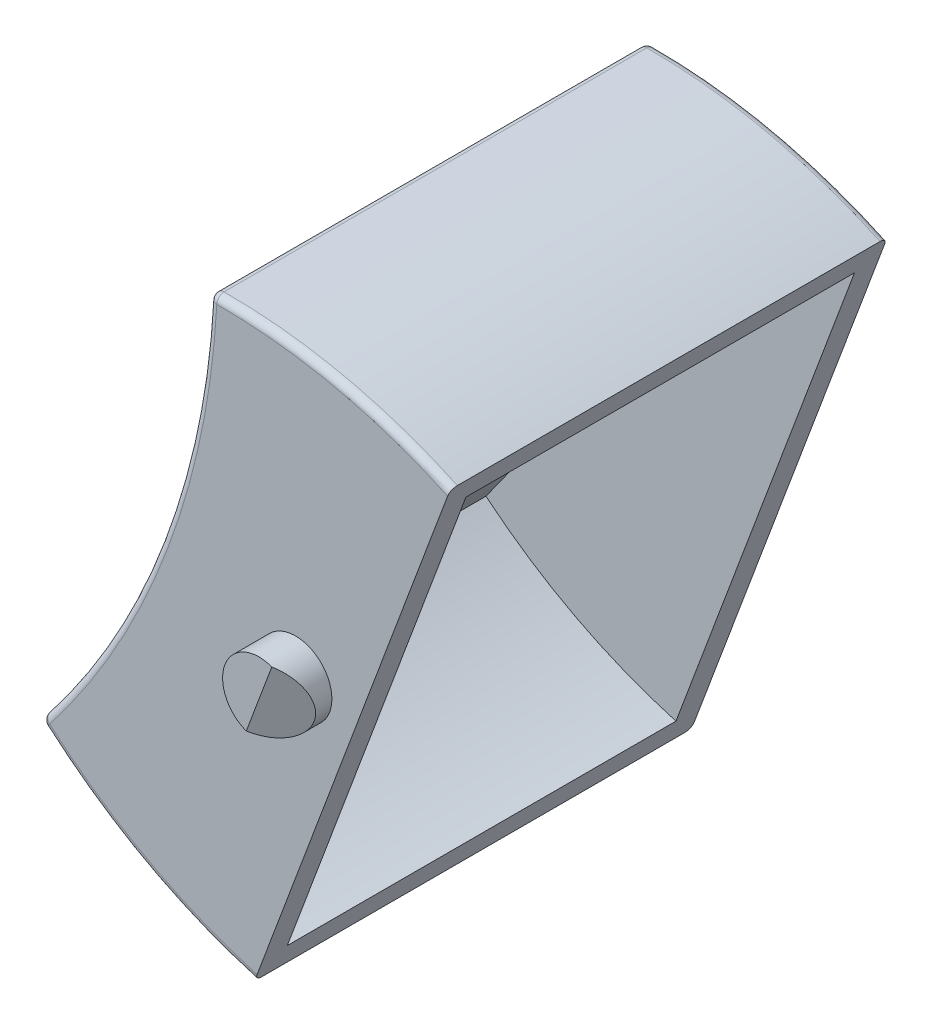
ISO-10303-21;
HEADER;
FILE_DESCRIPTION(('STEP AP214'),'2;1');
FILE_NAME('part.step','',(''),(''),'','','');
FILE_SCHEMA(('AUTOMOTIVE_DESIGN { 1 0 10303 214 1 1 1 1 }'));
ENDSEC;
DATA;
#1=APPLICATION_CONTEXT('core data for automotive mechanical design processes');
#2=APPLICATION_PROTOCOL_DEFINITION('international standard','automotive_design',2000,#1);
#3=PRODUCT_CONTEXT('',#1,'mechanical');
#4=PRODUCT('Part','Part','',(#3));
#5=PRODUCT_RELATED_PRODUCT_CATEGORY('part','',(#4));
#6=PRODUCT_DEFINITION_FORMATION('','',#4);
#7=PRODUCT_DEFINITION_CONTEXT('part definition',#1,'design');
#8=PRODUCT_DEFINITION('design','',#6,#7);
#9=PRODUCT_DEFINITION_SHAPE('','',#8);
#10=(LENGTH_UNIT() NAMED_UNIT(*) SI_UNIT(.MILLI.,.METRE.));
#11=(NAMED_UNIT(*) PLANE_ANGLE_UNIT() SI_UNIT($,.RADIAN.));
#12=(NAMED_UNIT(*) SI_UNIT($,.STERADIAN.) SOLID_ANGLE_UNIT());
#13=UNCERTAINTY_MEASURE_WITH_UNIT(LENGTH_MEASURE(1.E-05),#10,'distance_accuracy_value','');
#14=(GEOMETRIC_REPRESENTATION_CONTEXT(3) GLOBAL_UNCERTAINTY_ASSIGNED_CONTEXT((#13)) GLOBAL_UNIT_ASSIGNED_CONTEXT((#10,
#11,#12)) REPRESENTATION_CONTEXT('',''));
#15=CARTESIAN_POINT('',(0.,0.,0.));
#16=DIRECTION('',(0.,0.,1.));
#17=DIRECTION('',(1.,0.,0.));
#18=AXIS2_PLACEMENT_3D('',#15,#16,#17);
#19=CARTESIAN_POINT('',(-34.490029216,104.956120538,116.5));
#20=DIRECTION('',(0.,0.,-1.));
#21=DIRECTION('',(-1.,0.,0.));
#22=AXIS2_PLACEMENT_3D('',#19,#20,#21);
#23=CYLINDRICAL_SURFACE('',#22,33.5);
#24=DIRECTION('',(0.,0.,-1.));
#25=VECTOR('',#24,1.);
#26=CARTESIAN_POINT('',(-7.65791523712324,84.8990105908508,116.5));
#27=LINE('',#26,#25);
#28=CARTESIAN_POINT('',(-7.65791523716625,84.8990105908863,115.5));
#29=VERTEX_POINT('',#28);
#30=CARTESIAN_POINT('',(-7.65791523716625,84.8990105908863,99.5));
#31=VERTEX_POINT('',#30);
#32=EDGE_CURVE('E132',#29,#31,#27,.T.);
#33=ORIENTED_EDGE('',*,*,#32,.T.);
#34=CARTESIAN_POINT('',(-34.490029216,104.956120538,99.5));
#35=DIRECTION('',(0.,0.,-1.));
#36=DIRECTION('',(-1.,0.,0.));
#37=AXIS2_PLACEMENT_3D('',#34,#35,#36);
#38=CIRCLE('',#37,33.5);
#39=CARTESIAN_POINT('',(-1.08092766215445,102.48996292429,99.5));
#40=VERTEX_POINT('',#39);
#41=EDGE_CURVE('E753',#31,#40,#38,.F.);
#42=ORIENTED_EDGE('',*,*,#41,.T.);
#43=DIRECTION('',(0.,0.,-1.));
#44=VECTOR('',#43,1.);
#45=CARTESIAN_POINT('',(-1.08092766199277,102.489962924286,116.5));
#46=LINE('',#45,#44);
#47=CARTESIAN_POINT('',(-1.08092766215445,102.48996292429,115.5));
#48=VERTEX_POINT('',#47);
#49=EDGE_CURVE('E151',#40,#48,#46,.F.);
#50=ORIENTED_EDGE('',*,*,#49,.T.);
#51=CARTESIAN_POINT('',(-34.490029216,104.956120538,115.5));
#52=DIRECTION('',(0.,0.,-1.));
#53=DIRECTION('',(-1.,0.,0.));
#54=AXIS2_PLACEMENT_3D('',#51,#52,#53);
#55=CIRCLE('',#54,33.5);
#56=EDGE_CURVE('E135',#29,#48,#55,.F.);
#57=ORIENTED_EDGE('',*,*,#56,.F.);
#58=EDGE_LOOP('',(#33,#42,#50,#57));
#59=FACE_BOUND('',#58,.T.);
#60=ADVANCED_FACE('F17',(#59),#23,.T.);
#61=CARTESIAN_POINT('',(53.21530671,62.555954853,118.));
#62=DIRECTION('',(0.,0.,-1.));
#63=DIRECTION('',(-1.,0.,0.));
#64=AXIS2_PLACEMENT_3D('',#61,#62,#63);
#65=PLANE('',#64);
#66=CARTESIAN_POINT('',(1.5,91.5,118.));
#67=DIRECTION('',(0.,0.,1.));
#68=DIRECTION('',(1.,0.,0.));
#69=AXIS2_PLACEMENT_3D('',#66,#67,#68);
#70=CIRCLE('',#69,1.5);
#71=CARTESIAN_POINT('',(0.974688927684363,90.0949917162024,117.999999999873));
#72=VERTEX_POINT('',#71);
#73=CARTESIAN_POINT('',(2.02531107215055,92.9050082837749,118.000000000212));
#74=VERTEX_POINT('',#73);
#75=EDGE_CURVE('E755',#72,#74,#70,.F.);
#76=ORIENTED_EDGE('',*,*,#75,.F.);
#77=DIRECTION('',(-0.350207381296365,-0.936672189234602,-2.25759226112387E-10));
#78=VECTOR('',#77,1.);
#79=CARTESIAN_POINT('',(2.02531107182562,92.9050082839527,118.000000000423));
#80=LINE('',#79,#78);
#81=EDGE_CURVE('E148',#74,#72,#80,.T.);
#82=ORIENTED_EDGE('',*,*,#81,.F.);
#83=EDGE_LOOP('',(#76,#82));
#84=FACE_BOUND('',#83,.T.);
#85=ADVANCED_FACE('F671',(#84),#65,.F.);
#86=CARTESIAN_POINT('',(1.5,91.5,118.));
#87=DIRECTION('',(0.468336094799778,-0.17510369092514,0.866025403629759));
#88=DIRECTION('',(0.879615464828683,0.,-0.475685436012308));
#89=AXIS2_PLACEMENT_3D('',#86,#87,#88);
#90=PLANE('',#89);
#91=CARTESIAN_POINT('',(1.5,91.5,118.));
#92=DIRECTION('',(0.468336094799778,-0.17510369092514,0.866025403629759));
#93=DIRECTION('',(-0.811181910632072,0.3032884890585,0.500000000267914));
#94=AXIS2_PLACEMENT_3D('',#91,#92,#93);
#95=ELLIPSE('',#94,1.73205080787824,1.5);
#96=EDGE_CURVE('E759',#74,#72,#95,.F.);
#97=ORIENTED_EDGE('',*,*,#96,.F.);
#98=ORIENTED_EDGE('',*,*,#81,.T.);
#99=EDGE_LOOP('',(#97,#98));
#100=FACE_BOUND('',#99,.T.);
#101=ADVANCED_FACE('F663',(#100),#90,.T.);
#102=CARTESIAN_POINT('',(53.21530671,62.555954853,97.));
#103=DIRECTION('',(0.,0.,-1.));
#104=DIRECTION('',(-1.,0.,0.));
#105=AXIS2_PLACEMENT_3D('',#102,#103,#104);
#106=PLANE('',#105);
#107=DIRECTION('',(0.350207381296404,0.936672189234588,-2.25736096466042E-10));
#108=VECTOR('',#107,1.);
#109=CARTESIAN_POINT('',(0.97468892786267,90.0949917160513,97.0000000002539));
#110=LINE('',#109,#108);
#111=CARTESIAN_POINT('',(0.974688927643345,90.0949917163022,97.0000000000846));
#112=VERTEX_POINT('',#111);
#113=CARTESIAN_POINT('',(2.02531107209113,92.9050082838253,96.999999999746));
#114=VERTEX_POINT('',#113);
#115=EDGE_CURVE('E145',#112,#114,#110,.T.);
#116=ORIENTED_EDGE('',*,*,#115,.F.);
#117=CARTESIAN_POINT('',(1.5,91.5,96.9999999999153));
#118=DIRECTION('',(0.,0.,1.));
#119=DIRECTION('',(1.,0.,0.));
#120=AXIS2_PLACEMENT_3D('',#117,#118,#119);
#121=CIRCLE('',#120,1.5);
#122=EDGE_CURVE('E270',#114,#112,#121,.T.);
#123=ORIENTED_EDGE('',*,*,#122,.F.);
#124=EDGE_LOOP('',(#116,#123));
#125=FACE_BOUND('',#124,.T.);
#126=ADVANCED_FACE('F655',(#125),#106,.T.);
#127=CARTESIAN_POINT('',(1.5,91.5,97.));
#128=DIRECTION('',(0.468336094799778,-0.17510369092514,-0.866025403629759));
#129=DIRECTION('',(-0.879615464828683,0.,-0.475685436012308));
#130=AXIS2_PLACEMENT_3D('',#127,#128,#129);
#131=PLANE('',#130);
#132=ORIENTED_EDGE('',*,*,#115,.T.);
#133=CARTESIAN_POINT('',(1.5,91.5,97.));
#134=DIRECTION('',(0.468336094799778,-0.17510369092514,-0.866025403629759));
#135=DIRECTION('',(0.811181910632072,-0.3032884890585,0.500000000267913));
#136=AXIS2_PLACEMENT_3D('',#133,#134,#135);
#137=ELLIPSE('',#136,1.73205080787824,1.5);
#138=EDGE_CURVE('E266',#112,#114,#137,.F.);
#139=ORIENTED_EDGE('',*,*,#138,.F.);
#140=EDGE_LOOP('',(#132,#139));
#141=FACE_BOUND('',#140,.T.);
#142=ADVANCED_FACE('F648',(#141),#131,.T.);
#143=CARTESIAN_POINT('',(6.033135769,101.476257719,116.5));
#144=DIRECTION('',(0.,0.,-1.));
#145=DIRECTION('',(-1.,0.,0.));
#146=AXIS2_PLACEMENT_3D('',#143,#144,#145);
#147=CYLINDRICAL_SURFACE('',#146,21.5);
#148=DIRECTION('',(0.,0.,1.));
#149=VECTOR('',#148,1.);
#150=CARTESIAN_POINT('',(0.165613860126917,80.7923947664257,116.5));
#151=LINE('',#150,#149);
#152=CARTESIAN_POINT('',(0.165613860094153,80.7923947663381,99.5));
#153=VERTEX_POINT('',#152);
#154=CARTESIAN_POINT('',(0.165613860094153,80.7923947663381,115.5));
#155=VERTEX_POINT('',#154);
#156=EDGE_CURVE('E115',#153,#155,#151,.T.);
#157=ORIENTED_EDGE('',*,*,#156,.F.);
#158=CARTESIAN_POINT('',(6.033135769,101.476257719,99.5));
#159=DIRECTION('',(0.,0.,-1.));
#160=DIRECTION('',(-1.,0.,0.));
#161=AXIS2_PLACEMENT_3D('',#158,#159,#160);
#162=CIRCLE('',#161,21.5);
#163=EDGE_CURVE('E754',#153,#31,#162,.T.);
#164=ORIENTED_EDGE('',*,*,#163,.T.);
#165=ORIENTED_EDGE('',*,*,#32,.F.);
#166=CARTESIAN_POINT('',(6.033135769,101.476257719,115.5));
#167=DIRECTION('',(0.,0.,-1.));
#168=DIRECTION('',(-1.,0.,0.));
#169=AXIS2_PLACEMENT_3D('',#166,#167,#168);
#170=CIRCLE('',#169,21.5);
#171=EDGE_CURVE('E20',#155,#29,#170,.T.);
#172=ORIENTED_EDGE('',*,*,#171,.F.);
#173=EDGE_LOOP('',(#157,#164,#165,#172));
#174=FACE_BOUND('',#173,.T.);
#175=ADVANCED_FACE('F130',(#174),#147,.F.);
#176=CARTESIAN_POINT('',(53.21530671,62.555954853,115.5));
#177=DIRECTION('',(0.,0.,-1.));
#178=DIRECTION('',(-1.,0.,0.));
#179=AXIS2_PLACEMENT_3D('',#176,#177,#178);
#180=PLANE('',#179);
#181=CARTESIAN_POINT('',(-1.623812958,80.996818074,115.5));
#182=DIRECTION('',(0.,0.,-1.));
#183=DIRECTION('',(-1.,0.,0.));
#184=AXIS2_PLACEMENT_3D('',#181,#182,#183);
#185=CIRCLE('',#184,21.5);
#186=CARTESIAN_POINT('',(7.51774708607597,100.456568328117,115.5));
#187=VERTEX_POINT('',#186);
#188=EDGE_CURVE('E138',#48,#187,#185,.T.);
#189=ORIENTED_EDGE('',*,*,#188,.T.);
#190=DIRECTION('',(0.350207381113304,0.936672189303046,0.));
#191=VECTOR('',#190,1.);
#192=CARTESIAN_POINT('',(3.841680473,90.624481547,115.5));
#193=LINE('',#192,#191);
#194=EDGE_CURVE('E120',#155,#187,#193,.T.);
#195=ORIENTED_EDGE('',*,*,#194,.F.);
#196=ORIENTED_EDGE('',*,*,#171,.T.);
#197=ORIENTED_EDGE('',*,*,#56,.T.);
#198=EDGE_LOOP('',(#189,#195,#196,#197));
#199=FACE_BOUND('',#198,.T.);
#200=ADVANCED_FACE('F136',(#199),#180,.T.);
#201=CARTESIAN_POINT('',(-1.623812958,80.996818074,116.5));
#202=DIRECTION('',(0.,0.,-1.));
#203=DIRECTION('',(-1.,0.,0.));
#204=AXIS2_PLACEMENT_3D('',#201,#202,#203);
#205=CYLINDRICAL_SURFACE('',#204,21.5);
#206=ORIENTED_EDGE('',*,*,#49,.F.);
#207=CARTESIAN_POINT('',(-1.623812958,80.996818074,99.5));
#208=DIRECTION('',(0.,0.,-1.));
#209=DIRECTION('',(-1.,0.,0.));
#210=AXIS2_PLACEMENT_3D('',#207,#208,#209);
#211=CIRCLE('',#210,21.5);
#212=CARTESIAN_POINT('',(7.51774708607597,100.456568328117,99.5));
#213=VERTEX_POINT('',#212);
#214=EDGE_CURVE('E756',#40,#213,#211,.T.);
#215=ORIENTED_EDGE('',*,*,#214,.T.);
#216=DIRECTION('',(0.,0.,1.));
#217=VECTOR('',#216,1.);
#218=CARTESIAN_POINT('',(7.51774708601101,100.456568327943,116.5));
#219=LINE('',#218,#217);
#220=EDGE_CURVE('E140',#187,#213,#219,.F.);
#221=ORIENTED_EDGE('',*,*,#220,.F.);
#222=ORIENTED_EDGE('',*,*,#188,.F.);
#223=EDGE_LOOP('',(#206,#215,#221,#222));
#224=FACE_BOUND('',#223,.T.);
#225=ADVANCED_FACE('F628',(#224),#205,.F.);
#226=CARTESIAN_POINT('',(53.21530671,62.555954853,99.5));
#227=DIRECTION('',(0.,0.,-1.));
#228=DIRECTION('',(-1.,0.,0.));
#229=AXIS2_PLACEMENT_3D('',#226,#227,#228);
#230=PLANE('',#229);
#231=DIRECTION('',(0.350207381113304,0.936672189303046,0.));
#232=VECTOR('',#231,1.);
#233=CARTESIAN_POINT('',(3.841680473,90.624481547,99.5));
#234=LINE('',#233,#232);
#235=EDGE_CURVE('E123',#213,#153,#234,.F.);
#236=ORIENTED_EDGE('',*,*,#235,.F.);
#237=ORIENTED_EDGE('',*,*,#214,.F.);
#238=ORIENTED_EDGE('',*,*,#41,.F.);
#239=ORIENTED_EDGE('',*,*,#163,.F.);
#240=EDGE_LOOP('',(#236,#237,#238,#239));
#241=FACE_BOUND('',#240,.T.);
#242=ADVANCED_FACE('F621',(#241),#230,.F.);
#243=CARTESIAN_POINT('',(1.5,91.5,116.5));
#244=DIRECTION('',(0.,0.,1.));
#245=DIRECTION('',(1.,0.,0.));
#246=AXIS2_PLACEMENT_3D('',#243,#244,#245);
#247=CYLINDRICAL_SURFACE('',#246,1.5);
#248=CARTESIAN_POINT('',(1.5,91.5,116.5));
#249=DIRECTION('',(0.,0.,1.));
#250=DIRECTION('',(1.,0.,0.));
#251=AXIS2_PLACEMENT_3D('',#248,#249,#250);
#252=CIRCLE('',#251,1.5);
#253=CARTESIAN_POINT('',(3.,91.5,116.5));
#254=VERTEX_POINT('',#253);
#255=EDGE_CURVE('E211',#254,#254,#252,.T.);
#256=ORIENTED_EDGE('',*,*,#255,.T.);
#257=EDGE_LOOP('',(#256));
#258=FACE_BOUND('',#257,.T.);
#259=ORIENTED_EDGE('',*,*,#75,.T.);
#260=ORIENTED_EDGE('',*,*,#96,.T.);
#261=EDGE_LOOP('',(#259,#260));
#262=FACE_BOUND('',#261,.T.);
#263=ADVANCED_FACE('F285',(#258,#262),#247,.T.);
#264=CARTESIAN_POINT('',(6.033135769,101.476257719,116.2));
#265=DIRECTION('',(0.,0.,-1.));
#266=DIRECTION('',(-0.936672189303046,0.350207381113305,0.));
#267=AXIS2_PLACEMENT_3D('',#264,#265,#266);
#268=TOROIDAL_SURFACE('',#267,22.2,0.3);
#269=CARTESIAN_POINT('',(-8.61680471812018,84.7963523318632,116.2));
#270=DIRECTION('',(-0.751347089510669,0.659907229149558,0.));
#271=DIRECTION('',(-0.659907229149574,-0.751347089510654,0.));
#272=AXIS2_PLACEMENT_3D('',#269,#270,#271);
#273=CIRCLE('',#272,0.3);
#274=CARTESIAN_POINT('',(-8.61680471803504,84.796352332026,116.5));
#275=VERTEX_POINT('',#274);
#276=CARTESIAN_POINT('',(-8.81477688708849,84.5709482053274,116.2));
#277=VERTEX_POINT('',#276);
#278=EDGE_CURVE('E516',#275,#277,#273,.F.);
#279=ORIENTED_EDGE('',*,*,#278,.T.);
#280=CARTESIAN_POINT('',(6.033135769,101.476257719,116.2));
#281=DIRECTION('',(0.,0.,-1.));
#282=DIRECTION('',(-1.,0.,0.));
#283=AXIS2_PLACEMENT_3D('',#280,#281,#282);
#284=CIRCLE('',#283,22.5);
#285=CARTESIAN_POINT('',(-0.185704410216785,79.8527513699973,116.2));
#286=VERTEX_POINT('',#285);
#287=EDGE_CURVE('E214',#286,#277,#284,.T.);
#288=ORIENTED_EDGE('',*,*,#287,.F.);
#289=CARTESIAN_POINT('',(-0.0803194867335062,80.1346161505265,116.5));
#290=CARTESIAN_POINT('',(-0.0862615966179278,80.1187232557018,116.500014162364));
#291=CARTESIAN_POINT('',(-0.0922023188712643,80.1028340722664,116.498570294691));
#292=CARTESIAN_POINT('',(-0.103911910518038,80.0715153467492,116.492870488042));
#293=CARTESIAN_POINT('',(-0.109680896195495,80.0560854936516,116.488616499265));
#294=CARTESIAN_POINT('',(-0.12088950562797,80.0261067059317,116.477397299648));
#295=CARTESIAN_POINT('',(-0.126328959016273,80.0115582269759,116.470430699993));
#296=CARTESIAN_POINT('',(-0.136719284456847,79.9837680392112,116.453987398601));
#297=CARTESIAN_POINT('',(-0.141670254966378,79.9705260670663,116.444511204116));
#298=CARTESIAN_POINT('',(-0.150936733773212,79.9457417436644,116.423327646098));
#299=CARTESIAN_POINT('',(-0.155253067546282,79.9341971845721,116.411623227154));
#300=CARTESIAN_POINT('',(-0.163133750382465,79.9131193408623,116.3863058991));
#301=CARTESIAN_POINT('',(-0.166698130819534,79.9035859723312,116.372693069653));
#302=CARTESIAN_POINT('',(-0.172963708220898,79.8868279243334,116.343984868315));
#303=CARTESIAN_POINT('',(-0.175667119733192,79.879597321789,116.328893432697));
#304=CARTESIAN_POINT('',(-0.180144054375021,79.8676232161638,116.297629541309));
#305=CARTESIAN_POINT('',(-0.181918162331167,79.8628781488933,116.281457772656));
#306=CARTESIAN_POINT('',(-0.184033862333231,79.8572194521897,116.254318411066));
#307=CARTESIAN_POINT('',(-0.184659941417897,79.8555449276102,116.243524741066));
#308=CARTESIAN_POINT('',(-0.18549515056613,79.8533110592666,116.221822258065));
#309=CARTESIAN_POINT('',(-0.185704873062499,79.852750130969,116.210913630903));
#310=CARTESIAN_POINT('',(-0.185704409849106,79.8527513698916,116.2));
#311=B_SPLINE_CURVE_WITH_KNOTS('',3,(#289,#290,#291,#292,#293,#294,#295,#296,#297,#298,#299,
#300,#301,#302,#303,#304,#305,#306,#307,#308,#309,#310),.UNSPECIFIED.,.F.,.F.,(4,2,2,2,2,2,2,2,
2,2,4),(0.,0.0508352686674392,0.101635295129223,0.152461364705977,0.203277168902333,
0.254026280585741,0.304773274431037,0.355388664565932,0.405972163185518,0.438733540498586,
0.471448268218932),.UNSPECIFIED.);
#312=CARTESIAN_POINT('',(-0.0803194874089777,80.1346161507791,116.5));
#313=VERTEX_POINT('',#312);
#314=EDGE_CURVE('E260',#313,#286,#311,.T.);
#315=ORIENTED_EDGE('',*,*,#314,.F.);
#316=CARTESIAN_POINT('',(6.033135769,101.476257719,116.5));
#317=DIRECTION('',(0.,0.,-1.));
#318=DIRECTION('',(-0.275380867414003,-0.961335205774922,0.));
#319=AXIS2_PLACEMENT_3D('',#316,#317,#318);
#320=CIRCLE('',#319,22.1999999999527);
#321=EDGE_CURVE('E215',#313,#275,#320,.T.);
#322=ORIENTED_EDGE('',*,*,#321,.T.);
#323=EDGE_LOOP('',(#279,#288,#315,#322));
#324=FACE_BOUND('',#323,.T.);
#325=ADVANCED_FACE('F279',(#324),#268,.T.);
#326=CARTESIAN_POINT('',(6.033135769,101.476257719,98.8));
#327=DIRECTION('',(0.,0.,1.));
#328=DIRECTION('',(0.936672189303046,-0.350207381113305,0.));
#329=AXIS2_PLACEMENT_3D('',#326,#327,#328);
#330=TOROIDAL_SURFACE('',#329,22.2,0.3);
#331=CARTESIAN_POINT('',(-8.61680471867969,84.7963523323546,98.8));
#332=DIRECTION('',(0.751347089488533,-0.659907229174761,0.));
#333=DIRECTION('',(-0.659907229174777,-0.751347089488519,0.));
#334=AXIS2_PLACEMENT_3D('',#331,#332,#333);
#335=CIRCLE('',#334,0.3);
#336=CARTESIAN_POINT('',(-8.61680471829818,84.7963523322174,98.5));
#337=VERTEX_POINT('',#336);
#338=CARTESIAN_POINT('',(-8.81477688708849,84.5709482053274,98.8));
#339=VERTEX_POINT('',#338);
#340=EDGE_CURVE('E205',#337,#339,#335,.F.);
#341=ORIENTED_EDGE('',*,*,#340,.F.);
#342=CARTESIAN_POINT('',(6.033135769,101.476257719,98.5));
#343=DIRECTION('',(0.,0.,1.));
#344=DIRECTION('',(-0.659907229174761,-0.751347089488533,0.));
#345=AXIS2_PLACEMENT_3D('',#342,#343,#344);
#346=CIRCLE('',#345,22.1999999999089);
#347=CARTESIAN_POINT('',(-0.0803194874065705,80.1346161507875,98.5));
#348=VERTEX_POINT('',#347);
#349=EDGE_CURVE('E207',#348,#337,#346,.F.);
#350=ORIENTED_EDGE('',*,*,#349,.F.);
#351=CARTESIAN_POINT('',(-0.185704409849151,79.8527513698916,98.8));
#352=CARTESIAN_POINT('',(-0.185709503843249,79.8527377453831,98.783159593935));
#353=CARTESIAN_POINT('',(-0.185206620006871,79.8540827693024,98.7663237705207));
#354=CARTESIAN_POINT('',(-0.183222611835118,79.859389240208,98.7331432397995));
#355=CARTESIAN_POINT('',(-0.181742339284906,79.8633484089916,98.7167981178067));
#356=CARTESIAN_POINT('',(-0.177840268441937,79.8737849715433,98.6850428366531));
#357=CARTESIAN_POINT('',(-0.17541804553162,79.8802635010028,98.6696331027787));
#358=CARTESIAN_POINT('',(-0.169703849433167,79.8955468127152,98.640193621793));
#359=CARTESIAN_POINT('',(-0.166412008541974,79.904351241124,98.6261636652183));
#360=CARTESIAN_POINT('',(-0.159047020174395,79.924049797324,98.5998569808811));
#361=CARTESIAN_POINT('',(-0.154972776523846,79.9349468569662,98.5875827555638));
#362=CARTESIAN_POINT('',(-0.146162189638189,79.9585118420354,98.565154849635));
#363=CARTESIAN_POINT('',(-0.14142584044456,79.9711797833992,98.5550011881093));
#364=CARTESIAN_POINT('',(-0.131410223494661,79.9979677677813,98.5370691554797));
#365=CARTESIAN_POINT('',(-0.126129293376468,80.0120922569886,98.5292983633201));
#366=CARTESIAN_POINT('',(-0.115187342010146,80.0413578353119,98.5163945241608));
#367=CARTESIAN_POINT('',(-0.109526528480971,80.0564983688584,98.5112600487077));
#368=CARTESIAN_POINT('',(-0.0999139947670697,80.0822082581529,98.5050168021381));
#369=CARTESIAN_POINT('',(-0.0960215456724518,80.0926190861699,98.5031366298874));
#370=CARTESIAN_POINT('',(-0.0881930894432162,80.1135572434742,98.500628368706));
#371=CARTESIAN_POINT('',(-0.0842571519851313,80.1240843864031,98.4999985061703));
#372=CARTESIAN_POINT('',(-0.0803194867304591,80.1346161505347,98.5));
#373=B_SPLINE_CURVE_WITH_KNOTS('',3,(#351,#352,#353,#354,#355,#356,#357,#358,#359,#360,#361,
#362,#363,#364,#365,#366,#367,#368,#369,#370,#371,#372),.UNSPECIFIED.,.F.,.F.,(4,2,2,2,2,2,2,2,
2,2,4),(0.,0.0504534832785169,0.100863054748941,0.151295376513731,0.201720030309813,
0.252215853172372,0.302712130493965,0.353367388899114,0.403995171381723,0.4377472816094,
0.471451479055927),.UNSPECIFIED.);
#374=CARTESIAN_POINT('',(-0.185704410216792,79.8527513699973,98.8));
#375=VERTEX_POINT('',#374);
#376=EDGE_CURVE('E258',#375,#348,#373,.T.);
#377=ORIENTED_EDGE('',*,*,#376,.F.);
#378=CARTESIAN_POINT('',(6.033135769,101.476257719,98.8));
#379=DIRECTION('',(0.,0.,-1.));
#380=DIRECTION('',(-1.,0.,0.));
#381=AXIS2_PLACEMENT_3D('',#378,#379,#380);
#382=CIRCLE('',#381,22.5);
#383=EDGE_CURVE('E504',#339,#375,#382,.F.);
#384=ORIENTED_EDGE('',*,*,#383,.F.);
#385=EDGE_LOOP('',(#341,#350,#377,#384));
#386=FACE_BOUND('',#385,.T.);
#387=ADVANCED_FACE('F284',(#386),#330,.T.);
#388=CARTESIAN_POINT('',(1.5,91.5,116.5));
#389=DIRECTION('',(0.,0.,1.));
#390=DIRECTION('',(1.,0.,0.));
#391=AXIS2_PLACEMENT_3D('',#388,#389,#390);
#392=CYLINDRICAL_SURFACE('',#391,1.5);
#393=ORIENTED_EDGE('',*,*,#138,.T.);
#394=ORIENTED_EDGE('',*,*,#122,.T.);
#395=EDGE_LOOP('',(#393,#394));
#396=FACE_BOUND('',#395,.T.);
#397=CARTESIAN_POINT('',(1.5,91.5,98.5));
#398=DIRECTION('',(0.,0.,1.));
#399=DIRECTION('',(1.,0.,0.));
#400=AXIS2_PLACEMENT_3D('',#397,#398,#399);
#401=CIRCLE('',#400,1.5);
#402=CARTESIAN_POINT('',(3.,91.5,98.5));
#403=VERTEX_POINT('',#402);
#404=EDGE_CURVE('E199',#403,#403,#401,.T.);
#405=ORIENTED_EDGE('',*,*,#404,.F.);
#406=EDGE_LOOP('',(#405));
#407=FACE_BOUND('',#406,.T.);
#408=ADVANCED_FACE('F600',(#396,#407),#392,.T.);
#409=CARTESIAN_POINT('',(-1.623812958,80.996818074,116.2));
#410=DIRECTION('',(0.,0.,-1.));
#411=DIRECTION('',(-0.936672189303046,0.350207381113305,0.));
#412=AXIS2_PLACEMENT_3D('',#409,#410,#411);
#413=TOROIDAL_SURFACE('',#412,22.2,0.3);
#414=CARTESIAN_POINT('',(-1.73726086221528,103.196528197626,116.2));
#415=DIRECTION('',(0.999986942505682,0.00511026595564207,0.));
#416=DIRECTION('',(-0.00511026595562064,0.999986942505682,0.));
#417=AXIS2_PLACEMENT_3D('',#414,#415,#416);
#418=CIRCLE('',#417,0.3);
#419=CARTESIAN_POINT('',(-1.73726086264784,103.19652819707,116.5));
#420=VERTEX_POINT('',#419);
#421=CARTESIAN_POINT('',(-1.73879394239965,103.496524280065,116.2));
#422=VERTEX_POINT('',#421);
#423=EDGE_CURVE('E191',#420,#422,#418,.F.);
#424=ORIENTED_EDGE('',*,*,#423,.F.);
#425=CARTESIAN_POINT('',(-1.623812958,80.996818074,116.5));
#426=DIRECTION('',(0.,0.,-1.));
#427=DIRECTION('',(-0.0051102659556419,0.999986942505682,0.));
#428=AXIS2_PLACEMENT_3D('',#425,#426,#427);
#429=CIRCLE('',#428,22.1999999996889);
#430=CARTESIAN_POINT('',(7.76368043275407,101.114346943658,116.5));
#431=VERTEX_POINT('',#430);
#432=EDGE_CURVE('E219',#420,#431,#429,.T.);
#433=ORIENTED_EDGE('',*,*,#432,.T.);
#434=CARTESIAN_POINT('',(7.86906535605496,101.396211724659,116.2));
#435=CARTESIAN_POINT('',(7.86907045005065,101.396225349167,116.216840406065));
#436=CARTESIAN_POINT('',(7.86856756621366,101.394880325248,116.233676229479));
#437=CARTESIAN_POINT('',(7.86658355804001,101.389573854343,116.2668567602));
#438=CARTESIAN_POINT('',(7.86510328548852,101.38561468556,116.283201882193));
#439=CARTESIAN_POINT('',(7.86120121464601,101.375178123008,116.314957163346));
#440=CARTESIAN_POINT('',(7.85877899173744,101.368699593548,116.33036689722));
#441=CARTESIAN_POINT('',(7.85306479563918,101.353416281836,116.359806378206));
#442=CARTESIAN_POINT('',(7.84977295474643,101.344611853427,116.37383633478));
#443=CARTESIAN_POINT('',(7.84240796637878,101.324913297228,116.400143019118));
#444=CARTESIAN_POINT('',(7.83833372272972,101.314016237585,116.412417244435));
#445=CARTESIAN_POINT('',(7.82952313584443,101.290451252516,116.434845150364));
#446=CARTESIAN_POINT('',(7.82478678664967,101.277783311152,116.444998811889));
#447=CARTESIAN_POINT('',(7.81477116969964,101.25099532677,116.462930844519));
#448=CARTESIAN_POINT('',(7.80949023958245,101.236870837563,116.470701636679));
#449=CARTESIAN_POINT('',(7.79854828821641,101.207605259239,116.483605475838));
#450=CARTESIAN_POINT('',(7.79288747468652,101.192464725693,116.488739951292));
#451=CARTESIAN_POINT('',(7.78327494094985,101.166754836338,116.494983197876));
#452=CARTESIAN_POINT('',(7.77938249183226,101.156344008258,116.496863370134));
#453=CARTESIAN_POINT('',(7.77155403555659,101.135405850828,116.499371631316));
#454=CARTESIAN_POINT('',(7.76761809807504,101.124878707836,116.500001493844));
#455=CARTESIAN_POINT('',(7.76368043279671,101.114346943642,116.5));
#456=B_SPLINE_CURVE_WITH_KNOTS('',3,(#434,#435,#436,#437,#438,#439,#440,#441,#442,#443,#444,
#445,#446,#447,#448,#449,#450,#451,#452,#453,#454,#455),.UNSPECIFIED.,.F.,.F.,(4,2,2,2,2,2,2,2,
2,2,4),(0.,0.050453483278183,0.100863054748214,0.151295376512624,0.201720030308348,
0.252215853170765,0.302712130492199,0.353367388897406,0.403995171380547,0.437747281807391,
0.471451479453299),.UNSPECIFIED.);
#457=CARTESIAN_POINT('',(7.86906535667873,101.396211724369,116.2));
#458=VERTEX_POINT('',#457);
#459=EDGE_CURVE('E126',#458,#431,#456,.T.);
#460=ORIENTED_EDGE('',*,*,#459,.F.);
#461=CARTESIAN_POINT('',(-1.623812958,80.996818074,116.2));
#462=DIRECTION('',(0.,0.,-1.));
#463=DIRECTION('',(-1.,0.,0.));
#464=AXIS2_PLACEMENT_3D('',#461,#462,#463);
#465=CIRCLE('',#464,22.5);
#466=EDGE_CURVE('E193',#422,#458,#465,.T.);
#467=ORIENTED_EDGE('',*,*,#466,.F.);
#468=EDGE_LOOP('',(#424,#433,#460,#467));
#469=FACE_BOUND('',#468,.T.);
#470=ADVANCED_FACE('F236',(#469),#413,.T.);
#471=CARTESIAN_POINT('',(3.841680473,90.624481547,116.5));
#472=DIRECTION('',(0.936672189303046,-0.350207381113304,0.));
#473=DIRECTION('',(0.350207381113304,0.936672189303046,0.));
#474=AXIS2_PLACEMENT_3D('',#471,#472,#473);
#475=PLANE('',#474);
#476=ORIENTED_EDGE('',*,*,#220,.T.);
#477=ORIENTED_EDGE('',*,*,#235,.T.);
#478=ORIENTED_EDGE('',*,*,#156,.T.);
#479=ORIENTED_EDGE('',*,*,#194,.T.);
#480=EDGE_LOOP('',(#476,#477,#478,#479));
#481=FACE_BOUND('',#480,.T.);
#482=ORIENTED_EDGE('',*,*,#459,.T.);
#483=DIRECTION('',(-0.350207381148546,-0.936672189289869,0.));
#484=VECTOR('',#483,1.);
#485=CARTESIAN_POINT('',(7.76368043273537,101.114346943646,116.5));
#486=LINE('',#485,#484);
#487=EDGE_CURVE('E328',#431,#313,#486,.T.);
#488=ORIENTED_EDGE('',*,*,#487,.T.);
#489=ORIENTED_EDGE('',*,*,#314,.T.);
#490=DIRECTION('',(0.,0.,-1.));
#491=VECTOR('',#490,1.);
#492=CARTESIAN_POINT('',(-0.185704410584465,79.8527513701031,116.5));
#493=LINE('',#492,#491);
#494=EDGE_CURVE('E208',#375,#286,#493,.F.);
#495=ORIENTED_EDGE('',*,*,#494,.F.);
#496=ORIENTED_EDGE('',*,*,#376,.T.);
#497=DIRECTION('',(-0.350207381148547,-0.936672189289869,0.));
#498=VECTOR('',#497,1.);
#499=CARTESIAN_POINT('',(7.76368043273538,101.114346943646,98.5));
#500=LINE('',#499,#498);
#501=CARTESIAN_POINT('',(7.76368043274637,101.114346943642,98.5));
#502=VERTEX_POINT('',#501);
#503=EDGE_CURVE('E204',#502,#348,#500,.T.);
#504=ORIENTED_EDGE('',*,*,#503,.F.);
#505=CARTESIAN_POINT('',(7.86906535605497,101.396211724659,98.8));
#506=CARTESIAN_POINT('',(7.86907045005025,101.396225349167,98.7831595939351));
#507=CARTESIAN_POINT('',(7.86856756621342,101.394880325248,98.7663237705209));
#508=CARTESIAN_POINT('',(7.86658355804026,101.389573854343,98.7331432398));
#509=CARTESIAN_POINT('',(7.8651032854891,101.38561468556,98.7167981178073));
#510=CARTESIAN_POINT('',(7.86120121464648,101.375178123008,98.6850428366539));
#511=CARTESIAN_POINT('',(7.85877899173746,101.368699593548,98.6696331027797));
#512=CARTESIAN_POINT('',(7.85306479563916,101.353416281836,98.6401936217942));
#513=CARTESIAN_POINT('',(7.8497729547468,101.344611853427,98.6261636652196));
#514=CARTESIAN_POINT('',(7.84240796637919,101.324913297228,98.5998569808825));
#515=CARTESIAN_POINT('',(7.83833372272976,101.314016237585,98.5875827555652));
#516=CARTESIAN_POINT('',(7.8295231358444,101.290451252516,98.5651548496364));
#517=CARTESIAN_POINT('',(7.82478678664994,101.277783311152,98.5550011881107));
#518=CARTESIAN_POINT('',(7.81477116969995,101.25099532677,98.537069155481));
#519=CARTESIAN_POINT('',(7.8094902395825,101.236870837563,98.5292983633214));
#520=CARTESIAN_POINT('',(7.79854828821637,101.207605259239,98.5163945241617));
#521=CARTESIAN_POINT('',(7.79288747468666,101.192464725693,98.5112600487085));
#522=CARTESIAN_POINT('',(7.78327494094895,101.166754836335,98.5050168021232));
#523=CARTESIAN_POINT('',(7.77938249183022,101.156344008253,98.5031366298646));
#524=CARTESIAN_POINT('',(7.7715540355523,101.135405850817,98.500628368683));
#525=CARTESIAN_POINT('',(7.76761809806964,101.124878707822,98.4999985061548));
#526=CARTESIAN_POINT('',(7.76368043279033,101.114346943625,98.5));
#527=B_SPLINE_CURVE_WITH_KNOTS('',3,(#505,#506,#507,#508,#509,#510,#511,#512,#513,#514,#515,
#516,#517,#518,#519,#520,#521,#522,#523,#524,#525,#526),.UNSPECIFIED.,.F.,.F.,(4,2,2,2,2,2,2,2,
2,2,4),(0.,0.0504534832781832,0.100863054748215,0.151295376512612,0.201720030308338,
0.252215853170736,0.302712130492161,0.353367388897381,0.403995171380536,0.437747281816456,
0.471451479471454),.UNSPECIFIED.);
#528=CARTESIAN_POINT('',(7.86906535667873,101.396211724369,98.8));
#529=VERTEX_POINT('',#528);
#530=EDGE_CURVE('E216',#529,#502,#527,.T.);
#531=ORIENTED_EDGE('',*,*,#530,.F.);
#532=DIRECTION('',(0.,0.,-1.));
#533=VECTOR('',#532,1.);
#534=CARTESIAN_POINT('',(7.86906535730251,101.396211724078,116.5));
#535=LINE('',#534,#533);
#536=EDGE_CURVE('E383',#458,#529,#535,.T.);
#537=ORIENTED_EDGE('',*,*,#536,.F.);
#538=EDGE_LOOP('',(#482,#488,#489,#495,#496,#504,#531,#537));
#539=FACE_BOUND('',#538,.T.);
#540=ADVANCED_FACE('F117',(#481,#539),#475,.T.);
#541=CARTESIAN_POINT('',(-1.623812958,80.996818074,98.8));
#542=DIRECTION('',(0.,0.,1.));
#543=DIRECTION('',(0.936672189303046,-0.350207381113305,0.));
#544=AXIS2_PLACEMENT_3D('',#541,#542,#543);
#545=TOROIDAL_SURFACE('',#544,22.2,0.3);
#546=CARTESIAN_POINT('',(-1.73726086300317,103.196528197622,98.8));
#547=DIRECTION('',(-0.999986942505501,-0.00511026599113368,0.));
#548=DIRECTION('',(-0.00511026599111225,0.999986942505501,0.));
#549=AXIS2_PLACEMENT_3D('',#546,#547,#548);
#550=CIRCLE('',#549,0.3);
#551=CARTESIAN_POINT('',(-1.73879394239964,103.496524280065,98.8));
#552=VERTEX_POINT('',#551);
#553=CARTESIAN_POINT('',(-1.73726086297632,103.196528197237,98.5));
#554=VERTEX_POINT('',#553);
#555=EDGE_CURVE('E194',#552,#554,#550,.T.);
#556=ORIENTED_EDGE('',*,*,#555,.F.);
#557=CARTESIAN_POINT('',(-1.623812958,80.996818074,98.8));
#558=DIRECTION('',(0.,0.,-1.));
#559=DIRECTION('',(-1.,0.,0.));
#560=AXIS2_PLACEMENT_3D('',#557,#558,#559);
#561=CIRCLE('',#560,22.5);
#562=EDGE_CURVE('E188',#529,#552,#561,.F.);
#563=ORIENTED_EDGE('',*,*,#562,.F.);
#564=ORIENTED_EDGE('',*,*,#530,.T.);
#565=CARTESIAN_POINT('',(-1.623812958,80.996818074,98.5));
#566=DIRECTION('',(0.,0.,1.));
#567=DIRECTION('',(0.4228600626534,0.906194994144617,0.));
#568=AXIS2_PLACEMENT_3D('',#565,#566,#567);
#569=CIRCLE('',#568,22.1999999995978);
#570=EDGE_CURVE('E414',#554,#502,#569,.F.);
#571=ORIENTED_EDGE('',*,*,#570,.F.);
#572=EDGE_LOOP('',(#556,#563,#564,#571));
#573=FACE_BOUND('',#572,.T.);
#574=ADVANCED_FACE('F229',(#573),#545,.T.);
#575=CARTESIAN_POINT('',(53.21530671,62.555954853,116.5));
#576=DIRECTION('',(0.,0.,-1.));
#577=DIRECTION('',(-1.,0.,0.));
#578=AXIS2_PLACEMENT_3D('',#575,#576,#577);
#579=PLANE('',#578);
#580=ORIENTED_EDGE('',*,*,#255,.F.);
#581=EDGE_LOOP('',(#580));
#582=FACE_BOUND('',#581,.T.);
#583=ORIENTED_EDGE('',*,*,#487,.F.);
#584=ORIENTED_EDGE('',*,*,#432,.F.);
#585=CARTESIAN_POINT('',(-34.490029216,104.956120538,116.5));
#586=DIRECTION('',(0.,0.,1.));
#587=DIRECTION('',(0.788817820047677,-0.614627079435353,0.));
#588=AXIS2_PLACEMENT_3D('',#585,#586,#587);
#589=CIRCLE('',#588,32.800000000664);
#590=EDGE_CURVE('E182',#275,#420,#589,.T.);
#591=ORIENTED_EDGE('',*,*,#590,.F.);
#592=ORIENTED_EDGE('',*,*,#321,.F.);
#593=EDGE_LOOP('',(#583,#584,#591,#592));
#594=FACE_BOUND('',#593,.T.);
#595=ADVANCED_FACE('F578',(#582,#594),#579,.F.);
#596=CARTESIAN_POINT('',(6.033135769,101.476257719,116.5));
#597=DIRECTION('',(0.,0.,-1.));
#598=DIRECTION('',(-1.,0.,0.));
#599=AXIS2_PLACEMENT_3D('',#596,#597,#598);
#600=CYLINDRICAL_SURFACE('',#599,22.5);
#601=ORIENTED_EDGE('',*,*,#383,.T.);
#602=ORIENTED_EDGE('',*,*,#494,.T.);
#603=ORIENTED_EDGE('',*,*,#287,.T.);
#604=DIRECTION('',(0.,0.,-1.));
#605=VECTOR('',#604,1.);
#606=CARTESIAN_POINT('',(-8.81477688731193,84.5709482056449,116.5));
#607=LINE('',#606,#605);
#608=EDGE_CURVE('E179',#339,#277,#607,.F.);
#609=ORIENTED_EDGE('',*,*,#608,.F.);
#610=EDGE_LOOP('',(#601,#602,#603,#609));
#611=FACE_BOUND('',#610,.T.);
#612=ADVANCED_FACE('F571',(#611),#600,.T.);
#613=CARTESIAN_POINT('',(-8.616804718,84.796352332,116.2));
#614=DIRECTION('',(-0.995576428339502,-0.0939551772642723,0.));
#615=DIRECTION('',(0.0939551772642723,-0.995576428339502,0.));
#616=AXIS2_PLACEMENT_3D('',#613,#614,#615);
#617=SPHERICAL_SURFACE('',#616,0.3);
#618=CARTESIAN_POINT('',(-8.616804718,84.796352332,116.2));
#619=DIRECTION('',(0.,0.,-1.));
#620=DIRECTION('',(-1.,0.,0.));
#621=AXIS2_PLACEMENT_3D('',#618,#619,#620);
#622=CIRCLE('',#621,0.3);
#623=CARTESIAN_POINT('',(-8.91547764650185,84.7681657788207,116.2));
#624=VERTEX_POINT('',#623);
#625=CARTESIAN_POINT('',(-8.8534500642344,84.9807404560932,116.2));
#626=VERTEX_POINT('',#625);
#627=EDGE_CURVE('E172',#624,#626,#622,.T.);
#628=ORIENTED_EDGE('',*,*,#627,.F.);
#629=CARTESIAN_POINT('',(-8.616804718,84.796352332,116.2));
#630=DIRECTION('',(0.,0.,-1.));
#631=DIRECTION('',(-1.,0.,0.));
#632=AXIS2_PLACEMENT_3D('',#629,#630,#631);
#633=CIRCLE('',#632,0.3);
#634=EDGE_CURVE('E176',#277,#624,#633,.T.);
#635=ORIENTED_EDGE('',*,*,#634,.F.);
#636=ORIENTED_EDGE('',*,*,#278,.F.);
#637=CARTESIAN_POINT('',(-8.61680471843621,84.7963523325204,116.2));
#638=DIRECTION('',(-0.614627079435353,-0.788817820047677,0.));
#639=DIRECTION('',(0.788817820047675,-0.614627079435355,0.));
#640=AXIS2_PLACEMENT_3D('',#637,#638,#639);
#641=CIRCLE('',#640,0.3);
#642=EDGE_CURVE('E185',#626,#275,#641,.F.);
#643=ORIENTED_EDGE('',*,*,#642,.F.);
#644=EDGE_LOOP('',(#628,#635,#636,#643));
#645=FACE_BOUND('',#644,.T.);
#646=ADVANCED_FACE('F515',(#645),#617,.T.);
#647=CARTESIAN_POINT('',(-8.616804718,84.796352332,98.8));
#648=DIRECTION('',(-0.995576428339502,-0.0939551772642723,0.));
#649=DIRECTION('',(0.0939551772642723,-0.995576428339502,0.));
#650=AXIS2_PLACEMENT_3D('',#647,#648,#649);
#651=SPHERICAL_SURFACE('',#650,0.3);
#652=CARTESIAN_POINT('',(-8.616804718,84.796352332,98.8));
#653=DIRECTION('',(0.,0.,-1.));
#654=DIRECTION('',(-1.,0.,0.));
#655=AXIS2_PLACEMENT_3D('',#652,#653,#654);
#656=CIRCLE('',#655,0.3);
#657=CARTESIAN_POINT('',(-8.85345006423439,84.9807404560932,98.8));
#658=VERTEX_POINT('',#657);
#659=CARTESIAN_POINT('',(-8.91547764650185,84.7681657788207,98.8));
#660=VERTEX_POINT('',#659);
#661=EDGE_CURVE('E35',#658,#660,#656,.F.);
#662=ORIENTED_EDGE('',*,*,#661,.F.);
#663=CARTESIAN_POINT('',(-8.61680471852374,84.7963523324081,98.8));
#664=DIRECTION('',(-0.614627079438778,-0.788817820045008,0.));
#665=DIRECTION('',(0.788817820045006,-0.61462707943878,0.));
#666=AXIS2_PLACEMENT_3D('',#663,#664,#665);
#667=CIRCLE('',#666,0.3);
#668=EDGE_CURVE('E167',#337,#658,#667,.F.);
#669=ORIENTED_EDGE('',*,*,#668,.F.);
#670=ORIENTED_EDGE('',*,*,#340,.T.);
#671=CARTESIAN_POINT('',(-8.616804718,84.796352332,98.8));
#672=DIRECTION('',(0.,0.,-1.));
#673=DIRECTION('',(-1.,0.,0.));
#674=AXIS2_PLACEMENT_3D('',#671,#672,#673);
#675=CIRCLE('',#674,0.3);
#676=EDGE_CURVE('E177',#660,#339,#675,.F.);
#677=ORIENTED_EDGE('',*,*,#676,.F.);
#678=EDGE_LOOP('',(#662,#669,#670,#677));
#679=FACE_BOUND('',#678,.T.);
#680=ADVANCED_FACE('F507',(#679),#651,.T.);
#681=CARTESIAN_POINT('',(53.21530671,62.555954853,98.5));
#682=DIRECTION('',(0.,0.,-1.));
#683=DIRECTION('',(-1.,0.,0.));
#684=AXIS2_PLACEMENT_3D('',#681,#682,#683);
#685=PLANE('',#684);
#686=ORIENTED_EDGE('',*,*,#404,.T.);
#687=EDGE_LOOP('',(#686));
#688=FACE_BOUND('',#687,.T.);
#689=ORIENTED_EDGE('',*,*,#570,.T.);
#690=ORIENTED_EDGE('',*,*,#503,.T.);
#691=ORIENTED_EDGE('',*,*,#349,.T.);
#692=CARTESIAN_POINT('',(-34.490029216,104.956120538,98.5));
#693=DIRECTION('',(0.,0.,-1.));
#694=DIRECTION('',(0.998560010767038,-0.0536461079383425,0.));
#695=AXIS2_PLACEMENT_3D('',#692,#693,#694);
#696=CIRCLE('',#695,32.7999999999374);
#697=EDGE_CURVE('E166',#554,#337,#696,.T.);
#698=ORIENTED_EDGE('',*,*,#697,.F.);
#699=EDGE_LOOP('',(#689,#690,#691,#698));
#700=FACE_BOUND('',#699,.T.);
#701=ADVANCED_FACE('F374',(#688,#700),#685,.T.);
#702=CARTESIAN_POINT('',(-1.737260863,103.196528197,98.8));
#703=DIRECTION('',(-0.689730924745561,0.724065778399749,0.));
#704=DIRECTION('',(-0.724065778399749,-0.689730924745561,0.));
#705=AXIS2_PLACEMENT_3D('',#702,#703,#704);
#706=SPHERICAL_SURFACE('',#705,0.3);
#707=CARTESIAN_POINT('',(-1.737260863,103.196528197,98.8));
#708=DIRECTION('',(0.,0.,-1.));
#709=DIRECTION('',(-1.,0.,0.));
#710=AXIS2_PLACEMENT_3D('',#707,#708,#709);
#711=CIRCLE('',#710,0.3);
#712=CARTESIAN_POINT('',(-1.94418014042368,103.41374793052,98.8));
#713=VERTEX_POINT('',#712);
#714=EDGE_CURVE('E162',#552,#713,#711,.F.);
#715=ORIENTED_EDGE('',*,*,#714,.F.);
#716=ORIENTED_EDGE('',*,*,#555,.T.);
#717=CARTESIAN_POINT('',(-1.73726086284114,103.196528197622,98.8));
#718=DIRECTION('',(-0.0536461079383426,-0.998560010767038,0.));
#719=DIRECTION('',(0.998560010767038,-0.0536461079383452,0.));
#720=AXIS2_PLACEMENT_3D('',#717,#718,#719);
#721=CIRCLE('',#720,0.3);
#722=CARTESIAN_POINT('',(-2.03682886614995,103.212622029696,98.8));
#723=VERTEX_POINT('',#722);
#724=EDGE_CURVE('E163',#723,#554,#721,.T.);
#725=ORIENTED_EDGE('',*,*,#724,.F.);
#726=CARTESIAN_POINT('',(-1.737260863,103.196528197,98.8));
#727=DIRECTION('',(0.,0.,-1.));
#728=DIRECTION('',(-1.,0.,0.));
#729=AXIS2_PLACEMENT_3D('',#726,#727,#728);
#730=CIRCLE('',#729,0.3);
#731=EDGE_CURVE('E159',#713,#723,#730,.F.);
#732=ORIENTED_EDGE('',*,*,#731,.F.);
#733=EDGE_LOOP('',(#715,#716,#725,#732));
#734=FACE_BOUND('',#733,.T.);
#735=ADVANCED_FACE('F369',(#734),#706,.T.);
#736=CARTESIAN_POINT('',(-1.737260863,103.196528197,116.2));
#737=DIRECTION('',(-0.689730924745561,0.724065778399749,0.));
#738=DIRECTION('',(-0.724065778399749,-0.689730924745561,0.));
#739=AXIS2_PLACEMENT_3D('',#736,#737,#738);
#740=SPHERICAL_SURFACE('',#739,0.3);
#741=CARTESIAN_POINT('',(-1.737260863,103.196528197,116.2));
#742=DIRECTION('',(0.,0.,-1.));
#743=DIRECTION('',(-1.,0.,0.));
#744=AXIS2_PLACEMENT_3D('',#741,#742,#743);
#745=CIRCLE('',#744,0.3);
#746=CARTESIAN_POINT('',(-1.94418014042366,103.41374793052,116.2));
#747=VERTEX_POINT('',#746);
#748=EDGE_CURVE('E154',#747,#422,#745,.T.);
#749=ORIENTED_EDGE('',*,*,#748,.F.);
#750=CARTESIAN_POINT('',(-1.737260863,103.196528197,116.2));
#751=DIRECTION('',(0.,0.,-1.));
#752=DIRECTION('',(-1.,0.,0.));
#753=AXIS2_PLACEMENT_3D('',#750,#751,#752);
#754=CIRCLE('',#753,0.3);
#755=CARTESIAN_POINT('',(-2.03682886614995,103.212622029696,116.2));
#756=VERTEX_POINT('',#755);
#757=EDGE_CURVE('E158',#756,#747,#754,.T.);
#758=ORIENTED_EDGE('',*,*,#757,.F.);
#759=CARTESIAN_POINT('',(-1.73726086287493,103.196528196993,116.2));
#760=DIRECTION('',(-0.05364610795752,-0.998560010766008,0.));
#761=DIRECTION('',(0.998560010766008,-0.0536461079575226,0.));
#762=AXIS2_PLACEMENT_3D('',#759,#760,#761);
#763=CIRCLE('',#762,0.3);
#764=EDGE_CURVE('E180',#420,#756,#763,.T.);
#765=ORIENTED_EDGE('',*,*,#764,.F.);
#766=ORIENTED_EDGE('',*,*,#423,.T.);
#767=EDGE_LOOP('',(#749,#758,#765,#766));
#768=FACE_BOUND('',#767,.T.);
#769=ADVANCED_FACE('F366',(#768),#740,.T.);
#770=CARTESIAN_POINT('',(-1.623812958,80.996818074,116.5));
#771=DIRECTION('',(0.,0.,-1.));
#772=DIRECTION('',(-1.,0.,0.));
#773=AXIS2_PLACEMENT_3D('',#770,#771,#772);
#774=CYLINDRICAL_SURFACE('',#773,22.5);
#775=ORIENTED_EDGE('',*,*,#562,.T.);
#776=DIRECTION('',(0.,0.,-1.));
#777=VECTOR('',#776,1.);
#778=CARTESIAN_POINT('',(-1.73879394199875,103.496524279756,116.5));
#779=LINE('',#778,#777);
#780=EDGE_CURVE('E157',#422,#552,#779,.T.);
#781=ORIENTED_EDGE('',*,*,#780,.F.);
#782=ORIENTED_EDGE('',*,*,#466,.T.);
#783=ORIENTED_EDGE('',*,*,#536,.T.);
#784=EDGE_LOOP('',(#775,#781,#782,#783));
#785=FACE_BOUND('',#784,.T.);
#786=ADVANCED_FACE('F356',(#785),#774,.T.);
#787=CARTESIAN_POINT('',(-34.490029216,104.956120538,116.2));
#788=DIRECTION('',(0.,0.,-1.));
#789=DIRECTION('',(0.936672189250339,-0.350207381254276,0.));
#790=AXIS2_PLACEMENT_3D('',#787,#788,#789);
#791=TOROIDAL_SURFACE('',#790,32.8,0.3);
#792=ORIENTED_EDGE('',*,*,#764,.T.);
#793=CARTESIAN_POINT('',(-34.490029216,104.956120538,116.2));
#794=DIRECTION('',(0.,0.,-1.));
#795=DIRECTION('',(-1.,0.,0.));
#796=AXIS2_PLACEMENT_3D('',#793,#794,#795);
#797=CIRCLE('',#796,32.5);
#798=EDGE_CURVE('E365',#756,#626,#797,.T.);
#799=ORIENTED_EDGE('',*,*,#798,.T.);
#800=ORIENTED_EDGE('',*,*,#642,.T.);
#801=ORIENTED_EDGE('',*,*,#590,.T.);
#802=EDGE_LOOP('',(#792,#799,#800,#801));
#803=FACE_BOUND('',#802,.T.);
#804=ADVANCED_FACE('F344',(#803),#791,.T.);
#805=CARTESIAN_POINT('',(-8.616804718,84.796352332,116.5));
#806=DIRECTION('',(0.,0.,-1.));
#807=DIRECTION('',(-1.,0.,0.));
#808=AXIS2_PLACEMENT_3D('',#805,#806,#807);
#809=CYLINDRICAL_SURFACE('',#808,0.3);
#810=ORIENTED_EDGE('',*,*,#627,.T.);
#811=DIRECTION('',(0.,0.,-1.));
#812=VECTOR('',#811,1.);
#813=CARTESIAN_POINT('',(-8.85345006445049,84.980740456351,116.5));
#814=LINE('',#813,#812);
#815=EDGE_CURVE('E386',#626,#658,#814,.T.);
#816=ORIENTED_EDGE('',*,*,#815,.T.);
#817=ORIENTED_EDGE('',*,*,#661,.T.);
#818=ORIENTED_EDGE('',*,*,#676,.T.);
#819=ORIENTED_EDGE('',*,*,#608,.T.);
#820=ORIENTED_EDGE('',*,*,#634,.T.);
#821=EDGE_LOOP('',(#810,#816,#817,#818,#819,#820));
#822=FACE_BOUND('',#821,.T.);
#823=ADVANCED_FACE('F355',(#822),#809,.T.);
#824=CARTESIAN_POINT('',(-34.490029216,104.956120538,98.8));
#825=DIRECTION('',(0.,0.,-1.));
#826=DIRECTION('',(0.936672189250339,-0.350207381254276,0.));
#827=AXIS2_PLACEMENT_3D('',#824,#825,#826);
#828=TOROIDAL_SURFACE('',#827,32.8,0.3);
#829=ORIENTED_EDGE('',*,*,#724,.T.);
#830=ORIENTED_EDGE('',*,*,#697,.T.);
#831=ORIENTED_EDGE('',*,*,#668,.T.);
#832=CARTESIAN_POINT('',(-34.490029216,104.956120538,98.8));
#833=DIRECTION('',(0.,0.,-1.));
#834=DIRECTION('',(-1.,0.,0.));
#835=AXIS2_PLACEMENT_3D('',#832,#833,#834);
#836=CIRCLE('',#835,32.5);
#837=EDGE_CURVE('E26',#658,#723,#836,.F.);
#838=ORIENTED_EDGE('',*,*,#837,.T.);
#839=EDGE_LOOP('',(#829,#830,#831,#838));
#840=FACE_BOUND('',#839,.T.);
#841=ADVANCED_FACE('F434',(#840),#828,.T.);
#842=CARTESIAN_POINT('',(-1.737260863,103.196528197,116.5));
#843=DIRECTION('',(0.,0.,-1.));
#844=DIRECTION('',(-1.,0.,0.));
#845=AXIS2_PLACEMENT_3D('',#842,#843,#844);
#846=CYLINDRICAL_SURFACE('',#845,0.3);
#847=ORIENTED_EDGE('',*,*,#748,.T.);
#848=ORIENTED_EDGE('',*,*,#780,.T.);
#849=ORIENTED_EDGE('',*,*,#714,.T.);
#850=ORIENTED_EDGE('',*,*,#731,.T.);
#851=DIRECTION('',(0.,0.,-1.));
#852=VECTOR('',#851,1.);
#853=CARTESIAN_POINT('',(-2.03682886607125,103.212622030004,116.5));
#854=LINE('',#853,#852);
#855=EDGE_CURVE('E11',#723,#756,#854,.F.);
#856=ORIENTED_EDGE('',*,*,#855,.T.);
#857=ORIENTED_EDGE('',*,*,#757,.T.);
#858=EDGE_LOOP('',(#847,#848,#849,#850,#856,#857));
#859=FACE_BOUND('',#858,.T.);
#860=ADVANCED_FACE('F443',(#859),#846,.T.);
#861=CARTESIAN_POINT('',(-34.490029216,104.956120538,116.5));
#862=DIRECTION('',(0.,0.,-1.));
#863=DIRECTION('',(-1.,0.,0.));
#864=AXIS2_PLACEMENT_3D('',#861,#862,#863);
#865=CYLINDRICAL_SURFACE('',#864,32.5);
#866=ORIENTED_EDGE('',*,*,#837,.F.);
#867=ORIENTED_EDGE('',*,*,#815,.F.);
#868=ORIENTED_EDGE('',*,*,#798,.F.);
#869=ORIENTED_EDGE('',*,*,#855,.F.);
#870=EDGE_LOOP('',(#866,#867,#868,#869));
#871=FACE_BOUND('',#870,.T.);
#872=ADVANCED_FACE('F518',(#871),#865,.F.);
#873=CLOSED_SHELL('',(#60,#85,#101,#126,#142,#175,#200,#225,#242,#263,#325,#387,#408,#470,#540,
#574,#595,#612,#646,#680,#701,#735,#769,#786,#804,#823,#841,#860,#872));
#874=MANIFOLD_SOLID_BREP('B1',#873);
#875=ADVANCED_BREP_SHAPE_REPRESENTATION('',(#18,#874),#14);
#876=SHAPE_DEFINITION_REPRESENTATION(#9,#875);
ENDSEC;
END-ISO-10303-21;
